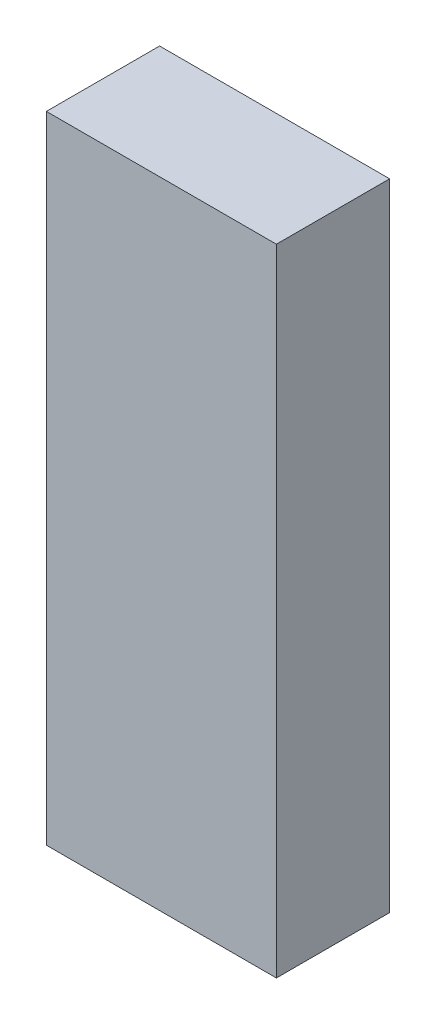
ISO-10303-21;
HEADER;
FILE_DESCRIPTION(('STEP AP214'),'2;1');
FILE_NAME('part.step','',(''),(''),'','','');
FILE_SCHEMA(('AUTOMOTIVE_DESIGN { 1 0 10303 214 1 1 1 1 }'));
ENDSEC;
DATA;
#1=APPLICATION_CONTEXT('core data for automotive mechanical design processes');
#2=APPLICATION_PROTOCOL_DEFINITION('international standard','automotive_design',2000,#1);
#3=PRODUCT_CONTEXT('',#1,'mechanical');
#4=PRODUCT('Part','Part','',(#3));
#5=PRODUCT_RELATED_PRODUCT_CATEGORY('part','',(#4));
#6=PRODUCT_DEFINITION_FORMATION('','',#4);
#7=PRODUCT_DEFINITION_CONTEXT('part definition',#1,'design');
#8=PRODUCT_DEFINITION('design','',#6,#7);
#9=PRODUCT_DEFINITION_SHAPE('','',#8);
#10=(LENGTH_UNIT() NAMED_UNIT(*) SI_UNIT(.MILLI.,.METRE.));
#11=(NAMED_UNIT(*) PLANE_ANGLE_UNIT() SI_UNIT($,.RADIAN.));
#12=(NAMED_UNIT(*) SI_UNIT($,.STERADIAN.) SOLID_ANGLE_UNIT());
#13=UNCERTAINTY_MEASURE_WITH_UNIT(LENGTH_MEASURE(1.E-05),#10,'distance_accuracy_value','');
#14=(GEOMETRIC_REPRESENTATION_CONTEXT(3) GLOBAL_UNCERTAINTY_ASSIGNED_CONTEXT((#13)) GLOBAL_UNIT_ASSIGNED_CONTEXT((#10,
#11,#12)) REPRESENTATION_CONTEXT('',''));
#15=CARTESIAN_POINT('',(0.,0.,0.));
#16=DIRECTION('',(0.,0.,1.));
#17=DIRECTION('',(1.,0.,0.));
#18=AXIS2_PLACEMENT_3D('',#15,#16,#17);
#19=CARTESIAN_POINT('',(-0.32500316,-2.34697778,0.31999936));
#20=DIRECTION('',(0.,0.,-1.));
#21=DIRECTION('',(-1.,0.,0.));
#22=AXIS2_PLACEMENT_3D('',#19,#20,#21);
#23=PLANE('',#22);
#24=DIRECTION('',(0.,1.,0.));
#25=VECTOR('',#24,1.);
#26=CARTESIAN_POINT('',(0.32499808,-4.1428035,0.31999936));
#27=LINE('',#26,#25);
#28=CARTESIAN_POINT('',(0.32499808,-4.1428035,0.31999936));
#29=VERTEX_POINT('',#28);
#30=CARTESIAN_POINT('',(0.32499808,-2.34697778,0.31999936));
#31=VERTEX_POINT('',#30);
#32=EDGE_CURVE('E80',#29,#31,#27,.T.);
#33=ORIENTED_EDGE('',*,*,#32,.T.);
#34=DIRECTION('',(1.,0.,0.));
#35=VECTOR('',#34,1.);
#36=CARTESIAN_POINT('',(0.32499808,-2.34697778,0.31999936));
#37=LINE('',#36,#35);
#38=CARTESIAN_POINT('',(-0.32500316,-2.34697778,0.31999936));
#39=VERTEX_POINT('',#38);
#40=EDGE_CURVE('E55',#31,#39,#37,.F.);
#41=ORIENTED_EDGE('',*,*,#40,.T.);
#42=DIRECTION('',(0.,1.,0.));
#43=VECTOR('',#42,1.);
#44=CARTESIAN_POINT('',(-0.32500316,-2.34697778,0.31999936));
#45=LINE('',#44,#43);
#46=CARTESIAN_POINT('',(-0.32500316,-4.1428035,0.31999936));
#47=VERTEX_POINT('',#46);
#48=EDGE_CURVE('E57',#39,#47,#45,.F.);
#49=ORIENTED_EDGE('',*,*,#48,.T.);
#50=DIRECTION('',(1.,0.,0.));
#51=VECTOR('',#50,1.);
#52=CARTESIAN_POINT('',(-0.32500316,-4.1428035,0.31999936));
#53=LINE('',#52,#51);
#54=EDGE_CURVE('E20',#47,#29,#53,.T.);
#55=ORIENTED_EDGE('',*,*,#54,.T.);
#56=EDGE_LOOP('',(#33,#41,#49,#55));
#57=FACE_BOUND('',#56,.T.);
#58=ADVANCED_FACE('F17',(#57),#23,.F.);
#59=CARTESIAN_POINT('',(-0.32500316,-4.1428035,0.));
#60=DIRECTION('',(0.,1.,0.));
#61=DIRECTION('',(0.,0.,1.));
#62=AXIS2_PLACEMENT_3D('',#59,#60,#61);
#63=PLANE('',#62);
#64=ORIENTED_EDGE('',*,*,#54,.F.);
#65=DIRECTION('',(0.,0.,-1.));
#66=VECTOR('',#65,1.);
#67=CARTESIAN_POINT('',(-0.32500316,-4.1428035,0.));
#68=LINE('',#67,#66);
#69=CARTESIAN_POINT('',(-0.32500316,-4.1428035,0.));
#70=VERTEX_POINT('',#69);
#71=EDGE_CURVE('E63',#47,#70,#68,.T.);
#72=ORIENTED_EDGE('',*,*,#71,.T.);
#73=DIRECTION('',(-1.,0.,0.));
#74=VECTOR('',#73,1.);
#75=CARTESIAN_POINT('',(-0.32500316,-4.1428035,0.));
#76=LINE('',#75,#74);
#77=CARTESIAN_POINT('',(0.32499808,-4.1428035,0.));
#78=VERTEX_POINT('',#77);
#79=EDGE_CURVE('E83',#78,#70,#76,.T.);
#80=ORIENTED_EDGE('',*,*,#79,.F.);
#81=DIRECTION('',(0.,0.,1.));
#82=VECTOR('',#81,1.);
#83=CARTESIAN_POINT('',(0.32499808,-4.1428035,0.));
#84=LINE('',#83,#82);
#85=EDGE_CURVE('E68',#78,#29,#84,.T.);
#86=ORIENTED_EDGE('',*,*,#85,.T.);
#87=EDGE_LOOP('',(#64,#72,#80,#86));
#88=FACE_BOUND('',#87,.T.);
#89=ADVANCED_FACE('F65',(#88),#63,.F.);
#90=CARTESIAN_POINT('',(-0.32500316,-2.34697778,0.));
#91=DIRECTION('',(1.,0.,0.));
#92=DIRECTION('',(0.,0.,-1.));
#93=AXIS2_PLACEMENT_3D('',#90,#91,#92);
#94=PLANE('',#93);
#95=ORIENTED_EDGE('',*,*,#48,.F.);
#96=DIRECTION('',(0.,0.,-1.));
#97=VECTOR('',#96,1.);
#98=CARTESIAN_POINT('',(-0.32500316,-2.34697778,0.));
#99=LINE('',#98,#97);
#100=CARTESIAN_POINT('',(-0.32500316,-2.34697778,0.));
#101=VERTEX_POINT('',#100);
#102=EDGE_CURVE('E75',#39,#101,#99,.T.);
#103=ORIENTED_EDGE('',*,*,#102,.T.);
#104=DIRECTION('',(0.,1.,0.));
#105=VECTOR('',#104,1.);
#106=CARTESIAN_POINT('',(-0.32500316,-2.34697778,0.));
#107=LINE('',#106,#105);
#108=EDGE_CURVE('E72',#70,#101,#107,.T.);
#109=ORIENTED_EDGE('',*,*,#108,.F.);
#110=ORIENTED_EDGE('',*,*,#71,.F.);
#111=EDGE_LOOP('',(#95,#103,#109,#110));
#112=FACE_BOUND('',#111,.T.);
#113=ADVANCED_FACE('F70',(#112),#94,.F.);
#114=CARTESIAN_POINT('',(0.32499808,-2.34697778,0.));
#115=DIRECTION('',(0.,-1.,0.));
#116=DIRECTION('',(0.,0.,-1.));
#117=AXIS2_PLACEMENT_3D('',#114,#115,#116);
#118=PLANE('',#117);
#119=ORIENTED_EDGE('',*,*,#40,.F.);
#120=DIRECTION('',(0.,0.,1.));
#121=VECTOR('',#120,1.);
#122=CARTESIAN_POINT('',(0.32499808,-2.34697778,0.));
#123=LINE('',#122,#121);
#124=CARTESIAN_POINT('',(0.32499808,-2.34697778,0.));
#125=VERTEX_POINT('',#124);
#126=EDGE_CURVE('E35',#31,#125,#123,.F.);
#127=ORIENTED_EDGE('',*,*,#126,.T.);
#128=DIRECTION('',(-1.,0.,0.));
#129=VECTOR('',#128,1.);
#130=CARTESIAN_POINT('',(-0.32500316,-2.34697778,0.));
#131=LINE('',#130,#129);
#132=EDGE_CURVE('E26',#101,#125,#131,.F.);
#133=ORIENTED_EDGE('',*,*,#132,.F.);
#134=ORIENTED_EDGE('',*,*,#102,.F.);
#135=EDGE_LOOP('',(#119,#127,#133,#134));
#136=FACE_BOUND('',#135,.T.);
#137=ADVANCED_FACE('F89',(#136),#118,.F.);
#138=CARTESIAN_POINT('',(0.32499808,-4.1428035,0.));
#139=DIRECTION('',(-1.,0.,0.));
#140=DIRECTION('',(0.,0.,1.));
#141=AXIS2_PLACEMENT_3D('',#138,#139,#140);
#142=PLANE('',#141);
#143=ORIENTED_EDGE('',*,*,#32,.F.);
#144=ORIENTED_EDGE('',*,*,#85,.F.);
#145=DIRECTION('',(0.,1.,0.));
#146=VECTOR('',#145,1.);
#147=CARTESIAN_POINT('',(0.32499808,-2.34697778,0.));
#148=LINE('',#147,#146);
#149=EDGE_CURVE('E11',#125,#78,#148,.F.);
#150=ORIENTED_EDGE('',*,*,#149,.F.);
#151=ORIENTED_EDGE('',*,*,#126,.F.);
#152=EDGE_LOOP('',(#143,#144,#150,#151));
#153=FACE_BOUND('',#152,.T.);
#154=ADVANCED_FACE('F91',(#153),#142,.F.);
#155=CARTESIAN_POINT('',(-0.32500316,-2.34697778,0.));
#156=DIRECTION('',(0.,0.,-1.));
#157=DIRECTION('',(-1.,0.,0.));
#158=AXIS2_PLACEMENT_3D('',#155,#156,#157);
#159=PLANE('',#158);
#160=ORIENTED_EDGE('',*,*,#132,.T.);
#161=ORIENTED_EDGE('',*,*,#149,.T.);
#162=ORIENTED_EDGE('',*,*,#79,.T.);
#163=ORIENTED_EDGE('',*,*,#108,.T.);
#164=EDGE_LOOP('',(#160,#161,#162,#163));
#165=FACE_BOUND('',#164,.T.);
#166=ADVANCED_FACE('F88',(#165),#159,.T.);
#167=CLOSED_SHELL('',(#58,#89,#113,#137,#154,#166));
#168=MANIFOLD_SOLID_BREP('B1',#167);
#169=ADVANCED_BREP_SHAPE_REPRESENTATION('',(#18,#168),#14);
#170=SHAPE_DEFINITION_REPRESENTATION(#9,#169);
ENDSEC;
END-ISO-10303-21;
